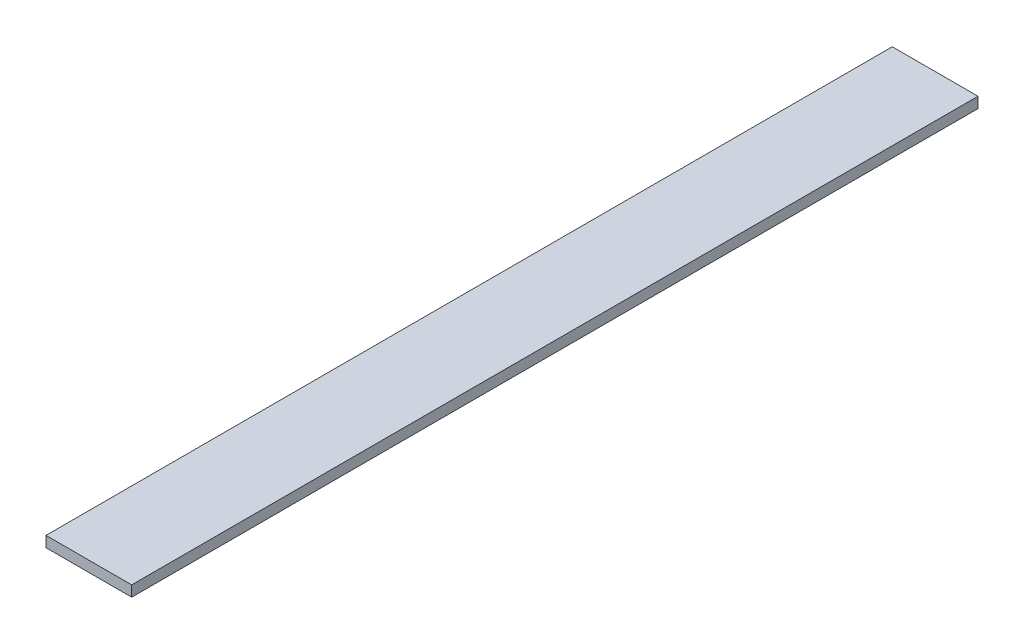
ISO-10303-21;
HEADER;
FILE_DESCRIPTION(('STEP AP214'),'2;1');
FILE_NAME('part.step','',(''),(''),'','','');
FILE_SCHEMA(('AUTOMOTIVE_DESIGN { 1 0 10303 214 1 1 1 1 }'));
ENDSEC;
DATA;
#1=APPLICATION_CONTEXT('core data for automotive mechanical design processes');
#2=APPLICATION_PROTOCOL_DEFINITION('international standard','automotive_design',2000,#1);
#3=PRODUCT_CONTEXT('',#1,'mechanical');
#4=PRODUCT('Part','Part','',(#3));
#5=PRODUCT_RELATED_PRODUCT_CATEGORY('part','',(#4));
#6=PRODUCT_DEFINITION_FORMATION('','',#4);
#7=PRODUCT_DEFINITION_CONTEXT('part definition',#1,'design');
#8=PRODUCT_DEFINITION('design','',#6,#7);
#9=PRODUCT_DEFINITION_SHAPE('','',#8);
#10=(LENGTH_UNIT() NAMED_UNIT(*) SI_UNIT(.MILLI.,.METRE.));
#11=(NAMED_UNIT(*) PLANE_ANGLE_UNIT() SI_UNIT($,.RADIAN.));
#12=(NAMED_UNIT(*) SI_UNIT($,.STERADIAN.) SOLID_ANGLE_UNIT());
#13=UNCERTAINTY_MEASURE_WITH_UNIT(LENGTH_MEASURE(1.E-05),#10,'distance_accuracy_value','');
#14=(GEOMETRIC_REPRESENTATION_CONTEXT(3) GLOBAL_UNCERTAINTY_ASSIGNED_CONTEXT((#13)) GLOBAL_UNIT_ASSIGNED_CONTEXT((#10,
#11,#12)) REPRESENTATION_CONTEXT('',''));
#15=CARTESIAN_POINT('',(0.,0.,0.));
#16=DIRECTION('',(0.,0.,1.));
#17=DIRECTION('',(1.,0.,0.));
#18=AXIS2_PLACEMENT_3D('',#15,#16,#17);
#19=CARTESIAN_POINT('',(25.4,6.35,250.825));
#20=DIRECTION('',(-1.,0.,0.));
#21=DIRECTION('',(0.,0.,1.));
#22=AXIS2_PLACEMENT_3D('',#19,#20,#21);
#23=PLANE('',#22);
#24=DIRECTION('',(0.,0.,-1.));
#25=VECTOR('',#24,1.);
#26=CARTESIAN_POINT('',(25.4,0.,250.825));
#27=LINE('',#26,#25);
#28=CARTESIAN_POINT('',(25.4,0.,250.825));
#29=VERTEX_POINT('',#28);
#30=CARTESIAN_POINT('',(25.4,0.,-250.825));
#31=VERTEX_POINT('',#30);
#32=EDGE_CURVE('E110',#29,#31,#27,.T.);
#33=ORIENTED_EDGE('',*,*,#32,.T.);
#34=DIRECTION('',(0.,-1.,0.));
#35=VECTOR('',#34,1.);
#36=CARTESIAN_POINT('',(25.4,6.35,-250.825));
#37=LINE('',#36,#35);
#38=CARTESIAN_POINT('',(25.4,6.35,-250.825));
#39=VERTEX_POINT('',#38);
#40=EDGE_CURVE('E11',#39,#31,#37,.T.);
#41=ORIENTED_EDGE('',*,*,#40,.F.);
#42=DIRECTION('',(0.,0.,-1.));
#43=VECTOR('',#42,1.);
#44=CARTESIAN_POINT('',(25.4,6.35,250.825));
#45=LINE('',#44,#43);
#46=CARTESIAN_POINT('',(25.4,6.35,250.825));
#47=VERTEX_POINT('',#46);
#48=EDGE_CURVE('E93',#47,#39,#45,.T.);
#49=ORIENTED_EDGE('',*,*,#48,.F.);
#50=DIRECTION('',(0.,-1.,0.));
#51=VECTOR('',#50,1.);
#52=CARTESIAN_POINT('',(25.4,6.35,250.825));
#53=LINE('',#52,#51);
#54=EDGE_CURVE('E106',#47,#29,#53,.T.);
#55=ORIENTED_EDGE('',*,*,#54,.T.);
#56=EDGE_LOOP('',(#33,#41,#49,#55));
#57=FACE_BOUND('',#56,.T.);
#58=ADVANCED_FACE('F41',(#57),#23,.F.);
#59=CARTESIAN_POINT('',(-25.4,6.35,-250.825));
#60=DIRECTION('',(0.,0.,1.));
#61=DIRECTION('',(1.,0.,0.));
#62=AXIS2_PLACEMENT_3D('',#59,#60,#61);
#63=PLANE('',#62);
#64=DIRECTION('',(-1.,0.,0.));
#65=VECTOR('',#64,1.);
#66=CARTESIAN_POINT('',(-25.4,0.,-250.825));
#67=LINE('',#66,#65);
#68=CARTESIAN_POINT('',(-25.4,0.,-250.825));
#69=VERTEX_POINT('',#68);
#70=EDGE_CURVE('E98',#31,#69,#67,.T.);
#71=ORIENTED_EDGE('',*,*,#70,.T.);
#72=DIRECTION('',(0.,-1.,0.));
#73=VECTOR('',#72,1.);
#74=CARTESIAN_POINT('',(-25.4,6.35,-250.825));
#75=LINE('',#74,#73);
#76=CARTESIAN_POINT('',(-25.4,6.35,-250.825));
#77=VERTEX_POINT('',#76);
#78=EDGE_CURVE('E50',#77,#69,#75,.T.);
#79=ORIENTED_EDGE('',*,*,#78,.F.);
#80=DIRECTION('',(-1.,0.,0.));
#81=VECTOR('',#80,1.);
#82=CARTESIAN_POINT('',(-25.4,6.35,-250.825));
#83=LINE('',#82,#81);
#84=EDGE_CURVE('E88',#39,#77,#83,.T.);
#85=ORIENTED_EDGE('',*,*,#84,.F.);
#86=ORIENTED_EDGE('',*,*,#40,.T.);
#87=EDGE_LOOP('',(#71,#79,#85,#86));
#88=FACE_BOUND('',#87,.T.);
#89=ADVANCED_FACE('F97',(#88),#63,.F.);
#90=CARTESIAN_POINT('',(-25.4,6.35,250.825));
#91=DIRECTION('',(1.,0.,0.));
#92=DIRECTION('',(0.,0.,-1.));
#93=AXIS2_PLACEMENT_3D('',#90,#91,#92);
#94=PLANE('',#93);
#95=DIRECTION('',(0.,0.,1.));
#96=VECTOR('',#95,1.);
#97=CARTESIAN_POINT('',(-25.4,0.,250.825));
#98=LINE('',#97,#96);
#99=CARTESIAN_POINT('',(-25.4,0.,250.825));
#100=VERTEX_POINT('',#99);
#101=EDGE_CURVE('E75',#69,#100,#98,.T.);
#102=ORIENTED_EDGE('',*,*,#101,.T.);
#103=DIRECTION('',(0.,-1.,0.));
#104=VECTOR('',#103,1.);
#105=CARTESIAN_POINT('',(-25.4,6.35,250.825));
#106=LINE('',#105,#104);
#107=CARTESIAN_POINT('',(-25.4,6.35,250.825));
#108=VERTEX_POINT('',#107);
#109=EDGE_CURVE('E100',#108,#100,#106,.T.);
#110=ORIENTED_EDGE('',*,*,#109,.F.);
#111=DIRECTION('',(0.,0.,1.));
#112=VECTOR('',#111,1.);
#113=CARTESIAN_POINT('',(-25.4,6.35,250.825));
#114=LINE('',#113,#112);
#115=EDGE_CURVE('E91',#77,#108,#114,.T.);
#116=ORIENTED_EDGE('',*,*,#115,.F.);
#117=ORIENTED_EDGE('',*,*,#78,.T.);
#118=EDGE_LOOP('',(#102,#110,#116,#117));
#119=FACE_BOUND('',#118,.T.);
#120=ADVANCED_FACE('F101',(#119),#94,.F.);
#121=CARTESIAN_POINT('',(-25.4,6.35,250.825));
#122=DIRECTION('',(0.,0.,-1.));
#123=DIRECTION('',(-1.,0.,0.));
#124=AXIS2_PLACEMENT_3D('',#121,#122,#123);
#125=PLANE('',#124);
#126=DIRECTION('',(1.,0.,0.));
#127=VECTOR('',#126,1.);
#128=CARTESIAN_POINT('',(-25.4,0.,250.825));
#129=LINE('',#128,#127);
#130=EDGE_CURVE('E81',#100,#29,#129,.T.);
#131=ORIENTED_EDGE('',*,*,#130,.T.);
#132=ORIENTED_EDGE('',*,*,#54,.F.);
#133=DIRECTION('',(1.,0.,0.));
#134=VECTOR('',#133,1.);
#135=CARTESIAN_POINT('',(-25.4,6.35,250.825));
#136=LINE('',#135,#134);
#137=EDGE_CURVE('E58',#108,#47,#136,.T.);
#138=ORIENTED_EDGE('',*,*,#137,.F.);
#139=ORIENTED_EDGE('',*,*,#109,.T.);
#140=EDGE_LOOP('',(#131,#132,#138,#139));
#141=FACE_BOUND('',#140,.T.);
#142=ADVANCED_FACE('F124',(#141),#125,.F.);
#143=CARTESIAN_POINT('',(0.,6.35,0.));
#144=DIRECTION('',(0.,-1.,0.));
#145=DIRECTION('',(0.,0.,-1.));
#146=AXIS2_PLACEMENT_3D('',#143,#144,#145);
#147=PLANE('',#146);
#148=ORIENTED_EDGE('',*,*,#48,.T.);
#149=ORIENTED_EDGE('',*,*,#84,.T.);
#150=ORIENTED_EDGE('',*,*,#115,.T.);
#151=ORIENTED_EDGE('',*,*,#137,.T.);
#152=EDGE_LOOP('',(#148,#149,#150,#151));
#153=FACE_BOUND('',#152,.T.);
#154=ADVANCED_FACE('F89',(#153),#147,.F.);
#155=CARTESIAN_POINT('',(0.,0.,0.));
#156=DIRECTION('',(0.,-1.,0.));
#157=DIRECTION('',(0.,0.,-1.));
#158=AXIS2_PLACEMENT_3D('',#155,#156,#157);
#159=PLANE('',#158);
#160=ORIENTED_EDGE('',*,*,#32,.F.);
#161=ORIENTED_EDGE('',*,*,#130,.F.);
#162=ORIENTED_EDGE('',*,*,#101,.F.);
#163=ORIENTED_EDGE('',*,*,#70,.F.);
#164=EDGE_LOOP('',(#160,#161,#162,#163));
#165=FACE_BOUND('',#164,.T.);
#166=ADVANCED_FACE('F127',(#165),#159,.T.);
#167=CLOSED_SHELL('',(#58,#89,#120,#142,#154,#166));
#168=MANIFOLD_SOLID_BREP('B2',#167);
#169=ADVANCED_BREP_SHAPE_REPRESENTATION('',(#18,#168),#14);
#170=SHAPE_DEFINITION_REPRESENTATION(#9,#169);
ENDSEC;
END-ISO-10303-21;
